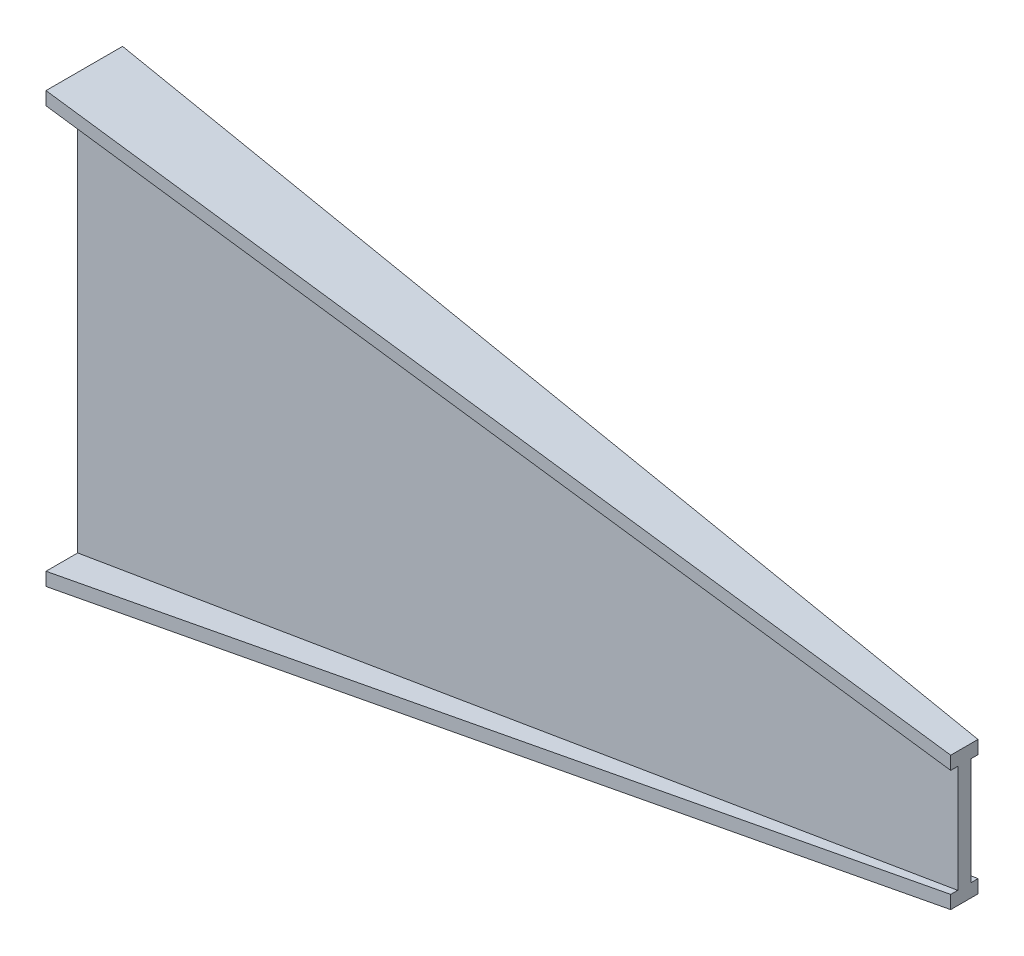
ISO-10303-21;
HEADER;
FILE_DESCRIPTION(('STEP AP214'),'2;1');
FILE_NAME('part.step','',(''),(''),'','','');
FILE_SCHEMA(('AUTOMOTIVE_DESIGN { 1 0 10303 214 1 1 1 1 }'));
ENDSEC;
DATA;
#1=APPLICATION_CONTEXT('core data for automotive mechanical design processes');
#2=APPLICATION_PROTOCOL_DEFINITION('international standard','automotive_design',2000,#1);
#3=PRODUCT_CONTEXT('',#1,'mechanical');
#4=PRODUCT('Part','Part','',(#3));
#5=PRODUCT_RELATED_PRODUCT_CATEGORY('part','',(#4));
#6=PRODUCT_DEFINITION_FORMATION('','',#4);
#7=PRODUCT_DEFINITION_CONTEXT('part definition',#1,'design');
#8=PRODUCT_DEFINITION('design','',#6,#7);
#9=PRODUCT_DEFINITION_SHAPE('','',#8);
#10=(LENGTH_UNIT() NAMED_UNIT(*) SI_UNIT(.MILLI.,.METRE.));
#11=(NAMED_UNIT(*) PLANE_ANGLE_UNIT() SI_UNIT($,.RADIAN.));
#12=(NAMED_UNIT(*) SI_UNIT($,.STERADIAN.) SOLID_ANGLE_UNIT());
#13=UNCERTAINTY_MEASURE_WITH_UNIT(LENGTH_MEASURE(1.E-05),#10,'distance_accuracy_value','');
#14=(GEOMETRIC_REPRESENTATION_CONTEXT(3) GLOBAL_UNCERTAINTY_ASSIGNED_CONTEXT((#13)) GLOBAL_UNIT_ASSIGNED_CONTEXT((#10,
#11,#12)) REPRESENTATION_CONTEXT('',''));
#15=CARTESIAN_POINT('',(0.,0.,0.));
#16=DIRECTION('',(0.,0.,1.));
#17=DIRECTION('',(1.,0.,0.));
#18=AXIS2_PLACEMENT_3D('',#15,#16,#17);
#19=CARTESIAN_POINT('',(1000.,0.,0.));
#20=DIRECTION('',(-1.,0.,0.));
#21=DIRECTION('',(0.,0.,1.));
#22=AXIS2_PLACEMENT_3D('',#19,#20,#21);
#23=PLANE('',#22);
#24=DIRECTION('',(0.,-1.,0.));
#25=VECTOR('',#24,1.);
#26=CARTESIAN_POINT('',(1000.,76.,-7.99999999999967));
#27=LINE('',#26,#25);
#28=CARTESIAN_POINT('',(1000.,76.,-7.99999999999967));
#29=VERTEX_POINT('',#28);
#30=CARTESIAN_POINT('',(1000.,61.,-7.99999999999967));
#31=VERTEX_POINT('',#30);
#32=EDGE_CURVE('E375',#29,#31,#27,.T.);
#33=ORIENTED_EDGE('',*,*,#32,.F.);
#34=DIRECTION('',(0.,0.,-1.));
#35=VECTOR('',#34,1.);
#36=CARTESIAN_POINT('',(1000.,76.,-7.99999999999967));
#37=LINE('',#36,#35);
#38=CARTESIAN_POINT('',(1000.,76.,23.0000000000004));
#39=VERTEX_POINT('',#38);
#40=EDGE_CURVE('E12',#39,#29,#37,.T.);
#41=ORIENTED_EDGE('',*,*,#40,.F.);
#42=DIRECTION('',(0.,1.,0.));
#43=VECTOR('',#42,1.);
#44=CARTESIAN_POINT('',(1000.,76.,23.0000000000004));
#45=LINE('',#44,#43);
#46=CARTESIAN_POINT('',(1000.,61.,23.0000000000004));
#47=VERTEX_POINT('',#46);
#48=EDGE_CURVE('E69',#47,#39,#45,.T.);
#49=ORIENTED_EDGE('',*,*,#48,.F.);
#50=DIRECTION('',(0.,0.,1.));
#51=VECTOR('',#50,1.);
#52=CARTESIAN_POINT('',(1000.,61.,15.0000000000003));
#53=LINE('',#52,#51);
#54=CARTESIAN_POINT('',(1000.,61.,15.0000000000003));
#55=VERTEX_POINT('',#54);
#56=EDGE_CURVE('E650',#55,#47,#53,.T.);
#57=ORIENTED_EDGE('',*,*,#56,.F.);
#58=DIRECTION('',(0.,1.,0.));
#59=VECTOR('',#58,1.);
#60=CARTESIAN_POINT('',(1000.,61.,15.0000000000003));
#61=LINE('',#60,#59);
#62=CARTESIAN_POINT('',(1000.,-61.,15.0000000000003));
#63=VERTEX_POINT('',#62);
#64=EDGE_CURVE('E412',#63,#55,#61,.T.);
#65=ORIENTED_EDGE('',*,*,#64,.F.);
#66=DIRECTION('',(0.,0.,-1.));
#67=VECTOR('',#66,1.);
#68=CARTESIAN_POINT('',(1000.,-61.,15.0000000000003));
#69=LINE('',#68,#67);
#70=CARTESIAN_POINT('',(1000.,-61.,23.0000000000004));
#71=VERTEX_POINT('',#70);
#72=EDGE_CURVE('E426',#71,#63,#69,.T.);
#73=ORIENTED_EDGE('',*,*,#72,.F.);
#74=DIRECTION('',(0.,1.,0.));
#75=VECTOR('',#74,1.);
#76=CARTESIAN_POINT('',(1000.,-61.,23.0000000000004));
#77=LINE('',#76,#75);
#78=CARTESIAN_POINT('',(1000.,-76.,23.0000000000004));
#79=VERTEX_POINT('',#78);
#80=EDGE_CURVE('E440',#79,#71,#77,.T.);
#81=ORIENTED_EDGE('',*,*,#80,.F.);
#82=DIRECTION('',(0.,0.,1.));
#83=VECTOR('',#82,1.);
#84=CARTESIAN_POINT('',(1000.,-76.,-7.99999999999967));
#85=LINE('',#84,#83);
#86=CARTESIAN_POINT('',(1000.,-76.,-7.99999999999967));
#87=VERTEX_POINT('',#86);
#88=EDGE_CURVE('E621',#87,#79,#85,.T.);
#89=ORIENTED_EDGE('',*,*,#88,.F.);
#90=DIRECTION('',(0.,-1.,0.));
#91=VECTOR('',#90,1.);
#92=CARTESIAN_POINT('',(1000.,-61.,-7.99999999999967));
#93=LINE('',#92,#91);
#94=CARTESIAN_POINT('',(1000.,-61.,-7.99999999999967));
#95=VERTEX_POINT('',#94);
#96=EDGE_CURVE('E613',#95,#87,#93,.T.);
#97=ORIENTED_EDGE('',*,*,#96,.F.);
#98=DIRECTION('',(0.,0.,-1.));
#99=VECTOR('',#98,1.);
#100=CARTESIAN_POINT('',(1000.,-61.,-7.99999999999967));
#101=LINE('',#100,#99);
#102=CARTESIAN_POINT('',(1000.,-61.,4.44089209850063E-13));
#103=VERTEX_POINT('',#102);
#104=EDGE_CURVE('E528',#103,#95,#101,.T.);
#105=ORIENTED_EDGE('',*,*,#104,.F.);
#106=DIRECTION('',(0.,-1.,0.));
#107=VECTOR('',#106,1.);
#108=CARTESIAN_POINT('',(1000.,61.,4.44089209850063E-13));
#109=LINE('',#108,#107);
#110=CARTESIAN_POINT('',(1000.,61.,4.44089209850063E-13));
#111=VERTEX_POINT('',#110);
#112=EDGE_CURVE('E83',#111,#103,#109,.T.);
#113=ORIENTED_EDGE('',*,*,#112,.F.);
#114=DIRECTION('',(0.,0.,1.));
#115=VECTOR('',#114,1.);
#116=CARTESIAN_POINT('',(1000.,61.,-7.99999999999967));
#117=LINE('',#116,#115);
#118=EDGE_CURVE('E77',#31,#111,#117,.T.);
#119=ORIENTED_EDGE('',*,*,#118,.F.);
#120=EDGE_LOOP('',(#33,#41,#49,#57,#65,#73,#81,#89,#97,#105,#113,#119));
#121=FACE_BOUND('',#120,.T.);
#122=ADVANCED_FACE('F59',(#121),#23,.F.);
#123=CARTESIAN_POINT('',(0.,0.,0.));
#124=DIRECTION('',(1.,0.,0.));
#125=DIRECTION('',(0.,0.,-1.));
#126=AXIS2_PLACEMENT_3D('',#123,#124,#125);
#127=PLANE('',#126);
#128=DIRECTION('',(0.,-1.,0.));
#129=VECTOR('',#128,1.);
#130=CARTESIAN_POINT('',(0.,244.,51.0000000000002));
#131=LINE('',#130,#129);
#132=CARTESIAN_POINT('',(0.,244.,51.0000000000002));
#133=VERTEX_POINT('',#132);
#134=CARTESIAN_POINT('',(0.,229.,51.0000000000002));
#135=VERTEX_POINT('',#134);
#136=EDGE_CURVE('E158',#133,#135,#131,.T.);
#137=ORIENTED_EDGE('',*,*,#136,.F.);
#138=DIRECTION('',(0.,0.,1.));
#139=VECTOR('',#138,1.);
#140=CARTESIAN_POINT('',(0.,244.,51.0000000000002));
#141=LINE('',#140,#139);
#142=CARTESIAN_POINT('',(0.,244.,-35.9999999999998));
#143=VERTEX_POINT('',#142);
#144=EDGE_CURVE('E167',#143,#133,#141,.T.);
#145=ORIENTED_EDGE('',*,*,#144,.F.);
#146=DIRECTION('',(0.,1.,0.));
#147=VECTOR('',#146,1.);
#148=CARTESIAN_POINT('',(0.,244.,-35.9999999999998));
#149=LINE('',#148,#147);
#150=CARTESIAN_POINT('',(0.,229.,-35.9999999999998));
#151=VERTEX_POINT('',#150);
#152=EDGE_CURVE('E174',#151,#143,#149,.T.);
#153=ORIENTED_EDGE('',*,*,#152,.F.);
#154=DIRECTION('',(0.,0.,-1.));
#155=VECTOR('',#154,1.);
#156=CARTESIAN_POINT('',(0.,229.,2.30106477373787E-13));
#157=LINE('',#156,#155);
#158=CARTESIAN_POINT('',(0.,229.,2.30106477373787E-13));
#159=VERTEX_POINT('',#158);
#160=EDGE_CURVE('E298',#159,#151,#157,.T.);
#161=ORIENTED_EDGE('',*,*,#160,.F.);
#162=DIRECTION('',(0.,1.,0.));
#163=VECTOR('',#162,1.);
#164=CARTESIAN_POINT('',(0.,229.,2.30106477373787E-13));
#165=LINE('',#164,#163);
#166=CARTESIAN_POINT('',(0.,-229.,2.30106477373787E-13));
#167=VERTEX_POINT('',#166);
#168=EDGE_CURVE('E294',#167,#159,#165,.T.);
#169=ORIENTED_EDGE('',*,*,#168,.F.);
#170=DIRECTION('',(0.,0.,1.));
#171=VECTOR('',#170,1.);
#172=CARTESIAN_POINT('',(0.,-229.,2.30106477373787E-13));
#173=LINE('',#172,#171);
#174=CARTESIAN_POINT('',(0.,-229.,-35.9999999999999));
#175=VERTEX_POINT('',#174);
#176=EDGE_CURVE('E290',#175,#167,#173,.T.);
#177=ORIENTED_EDGE('',*,*,#176,.F.);
#178=DIRECTION('',(0.,1.,0.));
#179=VECTOR('',#178,1.);
#180=CARTESIAN_POINT('',(0.,-229.,-35.9999999999999));
#181=LINE('',#180,#179);
#182=CARTESIAN_POINT('',(0.,-244.,-35.9999999999999));
#183=VERTEX_POINT('',#182);
#184=EDGE_CURVE('E286',#183,#175,#181,.T.);
#185=ORIENTED_EDGE('',*,*,#184,.F.);
#186=DIRECTION('',(0.,0.,-1.));
#187=VECTOR('',#186,1.);
#188=CARTESIAN_POINT('',(0.,-244.,51.0000000000001));
#189=LINE('',#188,#187);
#190=CARTESIAN_POINT('',(0.,-244.,51.0000000000001));
#191=VERTEX_POINT('',#190);
#192=EDGE_CURVE('E282',#191,#183,#189,.T.);
#193=ORIENTED_EDGE('',*,*,#192,.F.);
#194=DIRECTION('',(0.,-1.,0.));
#195=VECTOR('',#194,1.);
#196=CARTESIAN_POINT('',(0.,-229.,51.0000000000001));
#197=LINE('',#196,#195);
#198=CARTESIAN_POINT('',(0.,-229.,51.0000000000001));
#199=VERTEX_POINT('',#198);
#200=EDGE_CURVE('E278',#199,#191,#197,.T.);
#201=ORIENTED_EDGE('',*,*,#200,.F.);
#202=DIRECTION('',(0.,0.,1.));
#203=VECTOR('',#202,1.);
#204=CARTESIAN_POINT('',(0.,-229.,51.0000000000001));
#205=LINE('',#204,#203);
#206=CARTESIAN_POINT('',(0.,-229.,15.0000000000002));
#207=VERTEX_POINT('',#206);
#208=EDGE_CURVE('E273',#207,#199,#205,.T.);
#209=ORIENTED_EDGE('',*,*,#208,.F.);
#210=DIRECTION('',(0.,-1.,0.));
#211=VECTOR('',#210,1.);
#212=CARTESIAN_POINT('',(0.,229.,15.0000000000002));
#213=LINE('',#212,#211);
#214=CARTESIAN_POINT('',(0.,229.,15.0000000000002));
#215=VERTEX_POINT('',#214);
#216=EDGE_CURVE('E271',#215,#207,#213,.T.);
#217=ORIENTED_EDGE('',*,*,#216,.F.);
#218=DIRECTION('',(0.,0.,-1.));
#219=VECTOR('',#218,1.);
#220=CARTESIAN_POINT('',(0.,229.,51.0000000000002));
#221=LINE('',#220,#219);
#222=EDGE_CURVE('E180',#135,#215,#221,.T.);
#223=ORIENTED_EDGE('',*,*,#222,.F.);
#224=EDGE_LOOP('',(#137,#145,#153,#161,#169,#177,#185,#193,#201,#209,#217,#223));
#225=FACE_BOUND('',#224,.T.);
#226=ADVANCED_FACE('F178',(#225),#127,.F.);
#227=CARTESIAN_POINT('',(0.,0.,15.0000000000002));
#228=DIRECTION('',(0.,0.,1.));
#229=DIRECTION('',(1.,0.,0.));
#230=AXIS2_PLACEMENT_3D('',#227,#228,#229);
#231=PLANE('',#230);
#232=DIRECTION('',(0.9861798660721,0.165678217500113,0.));
#233=VECTOR('',#232,1.);
#234=CARTESIAN_POINT('',(0.,-229.,15.0000000000002));
#235=LINE('',#234,#233);
#236=EDGE_CURVE('E173',#207,#63,#235,.T.);
#237=ORIENTED_EDGE('',*,*,#236,.T.);
#238=ORIENTED_EDGE('',*,*,#64,.T.);
#239=DIRECTION('',(0.9861798660721,-0.165678217500113,0.));
#240=VECTOR('',#239,1.);
#241=CARTESIAN_POINT('',(0.,229.,15.0000000000002));
#242=LINE('',#241,#240);
#243=EDGE_CURVE('E385',#215,#55,#242,.T.);
#244=ORIENTED_EDGE('',*,*,#243,.F.);
#245=ORIENTED_EDGE('',*,*,#216,.T.);
#246=EDGE_LOOP('',(#237,#238,#244,#245));
#247=FACE_BOUND('',#246,.T.);
#248=ADVANCED_FACE('F201',(#247),#231,.T.);
#249=CARTESIAN_POINT('',(37.4159716170796,222.714116768331,0.));
#250=DIRECTION('',(-0.165678217500113,-0.9861798660721,0.));
#251=DIRECTION('',(0.9861798660721,-0.165678217500113,0.));
#252=AXIS2_PLACEMENT_3D('',#249,#250,#251);
#253=PLANE('',#252);
#254=ORIENTED_EDGE('',*,*,#243,.T.);
#255=ORIENTED_EDGE('',*,*,#56,.T.);
#256=DIRECTION('',(0.98580410983915,-0.165615090452977,-0.0276025150754961));
#257=VECTOR('',#256,1.);
#258=CARTESIAN_POINT('',(0.,229.,51.0000000000002));
#259=LINE('',#258,#257);
#260=EDGE_CURVE('E163',#135,#47,#259,.T.);
#261=ORIENTED_EDGE('',*,*,#260,.F.);
#262=ORIENTED_EDGE('',*,*,#222,.T.);
#263=EDGE_LOOP('',(#254,#255,#261,#262));
#264=FACE_BOUND('',#263,.T.);
#265=ADVANCED_FACE('F387',(#264),#253,.T.);
#266=CARTESIAN_POINT('',(37.4159716170795,-222.714116768331,0.));
#267=DIRECTION('',(-0.165678217500113,0.9861798660721,0.));
#268=DIRECTION('',(-0.9861798660721,-0.165678217500113,0.));
#269=AXIS2_PLACEMENT_3D('',#266,#267,#268);
#270=PLANE('',#269);
#271=DIRECTION('',(0.98580410983915,0.165615090452977,-0.0276025150754959));
#272=VECTOR('',#271,1.);
#273=CARTESIAN_POINT('',(0.,-229.,51.0000000000001));
#274=LINE('',#273,#272);
#275=EDGE_CURVE('E473',#199,#71,#274,.T.);
#276=ORIENTED_EDGE('',*,*,#275,.T.);
#277=ORIENTED_EDGE('',*,*,#72,.T.);
#278=ORIENTED_EDGE('',*,*,#236,.F.);
#279=ORIENTED_EDGE('',*,*,#208,.T.);
#280=EDGE_LOOP('',(#276,#277,#278,#279));
#281=FACE_BOUND('',#280,.T.);
#282=ADVANCED_FACE('F396',(#281),#270,.T.);
#283=CARTESIAN_POINT('',(1.42688132504116,0.,50.9600473228989));
#284=DIRECTION('',(0.0279890304496741,0.,0.999608230345512));
#285=DIRECTION('',(0.999608230345513,0.,-0.0279890304496741));
#286=AXIS2_PLACEMENT_3D('',#283,#284,#285);
#287=PLANE('',#286);
#288=DIRECTION('',(0.98580410983915,0.165615090452977,-0.0276025150754959));
#289=VECTOR('',#288,1.);
#290=CARTESIAN_POINT('',(0.,-244.,51.0000000000001));
#291=LINE('',#290,#289);
#292=EDGE_CURVE('E465',#191,#79,#291,.T.);
#293=ORIENTED_EDGE('',*,*,#292,.T.);
#294=ORIENTED_EDGE('',*,*,#80,.T.);
#295=ORIENTED_EDGE('',*,*,#275,.F.);
#296=ORIENTED_EDGE('',*,*,#200,.T.);
#297=EDGE_LOOP('',(#293,#294,#295,#296));
#298=FACE_BOUND('',#297,.T.);
#299=ADVANCED_FACE('F446',(#298),#287,.T.);
#300=CARTESIAN_POINT('',(39.8667994522594,-237.30237769202,-2.124665834774E-13));
#301=DIRECTION('',(0.165678217500113,-0.9861798660721,0.));
#302=DIRECTION('',(0.9861798660721,0.165678217500113,0.));
#303=AXIS2_PLACEMENT_3D('',#300,#301,#302);
#304=PLANE('',#303);
#305=DIRECTION('',(0.98580410983915,0.165615090452977,0.0276025150754964));
#306=VECTOR('',#305,1.);
#307=CARTESIAN_POINT('',(0.,-244.,-35.9999999999999));
#308=LINE('',#307,#306);
#309=EDGE_CURVE('E472',#183,#87,#308,.T.);
#310=ORIENTED_EDGE('',*,*,#309,.T.);
#311=ORIENTED_EDGE('',*,*,#88,.T.);
#312=ORIENTED_EDGE('',*,*,#292,.F.);
#313=ORIENTED_EDGE('',*,*,#192,.T.);
#314=EDGE_LOOP('',(#310,#311,#312,#313));
#315=FACE_BOUND('',#314,.T.);
#316=ADVANCED_FACE('F455',(#315),#304,.T.);
#317=CARTESIAN_POINT('',(1.00721034708789,0.,-35.9717981102814));
#318=DIRECTION('',(0.0279890304496746,0.,-0.999608230345512));
#319=DIRECTION('',(-0.999608230345512,0.,-0.0279890304496746));
#320=AXIS2_PLACEMENT_3D('',#317,#318,#319);
#321=PLANE('',#320);
#322=DIRECTION('',(0.98580410983915,0.165615090452977,0.0276025150754964));
#323=VECTOR('',#322,1.);
#324=CARTESIAN_POINT('',(0.,-229.,-35.9999999999999));
#325=LINE('',#324,#323);
#326=EDGE_CURVE('E490',#175,#95,#325,.T.);
#327=ORIENTED_EDGE('',*,*,#326,.T.);
#328=ORIENTED_EDGE('',*,*,#96,.T.);
#329=ORIENTED_EDGE('',*,*,#309,.F.);
#330=ORIENTED_EDGE('',*,*,#184,.T.);
#331=EDGE_LOOP('',(#327,#328,#329,#330));
#332=FACE_BOUND('',#331,.T.);
#333=ADVANCED_FACE('F501',(#332),#321,.T.);
#334=CARTESIAN_POINT('',(37.4159716170796,-222.714116768331,0.));
#335=DIRECTION('',(-0.165678217500113,0.9861798660721,0.));
#336=DIRECTION('',(-0.9861798660721,-0.165678217500113,0.));
#337=AXIS2_PLACEMENT_3D('',#334,#335,#336);
#338=PLANE('',#337);
#339=DIRECTION('',(0.9861798660721,0.165678217500113,0.));
#340=VECTOR('',#339,1.);
#341=CARTESIAN_POINT('',(0.,-229.,2.30106477373787E-13));
#342=LINE('',#341,#340);
#343=EDGE_CURVE('E567',#167,#103,#342,.T.);
#344=ORIENTED_EDGE('',*,*,#343,.T.);
#345=ORIENTED_EDGE('',*,*,#104,.T.);
#346=ORIENTED_EDGE('',*,*,#326,.F.);
#347=ORIENTED_EDGE('',*,*,#176,.T.);
#348=EDGE_LOOP('',(#344,#345,#346,#347));
#349=FACE_BOUND('',#348,.T.);
#350=ADVANCED_FACE('F510',(#349),#338,.T.);
#351=CARTESIAN_POINT('',(0.,0.,2.30106477373787E-13));
#352=DIRECTION('',(0.,0.,-1.));
#353=DIRECTION('',(-1.,0.,0.));
#354=AXIS2_PLACEMENT_3D('',#351,#352,#353);
#355=PLANE('',#354);
#356=DIRECTION('',(0.9861798660721,-0.165678217500113,0.));
#357=VECTOR('',#356,1.);
#358=CARTESIAN_POINT('',(0.,229.,2.30106477373787E-13));
#359=LINE('',#358,#357);
#360=EDGE_CURVE('E559',#159,#111,#359,.T.);
#361=ORIENTED_EDGE('',*,*,#360,.T.);
#362=ORIENTED_EDGE('',*,*,#112,.T.);
#363=ORIENTED_EDGE('',*,*,#343,.F.);
#364=ORIENTED_EDGE('',*,*,#168,.T.);
#365=EDGE_LOOP('',(#361,#362,#363,#364));
#366=FACE_BOUND('',#365,.T.);
#367=ADVANCED_FACE('F544',(#366),#355,.T.);
#368=CARTESIAN_POINT('',(37.4159716170795,222.714116768331,0.));
#369=DIRECTION('',(-0.165678217500113,-0.9861798660721,0.));
#370=DIRECTION('',(0.9861798660721,-0.165678217500113,0.));
#371=AXIS2_PLACEMENT_3D('',#368,#369,#370);
#372=PLANE('',#371);
#373=DIRECTION('',(0.98580410983915,-0.165615090452977,0.0276025150754963));
#374=VECTOR('',#373,1.);
#375=CARTESIAN_POINT('',(0.,229.,-35.9999999999998));
#376=LINE('',#375,#374);
#377=EDGE_CURVE('E566',#151,#31,#376,.T.);
#378=ORIENTED_EDGE('',*,*,#377,.T.);
#379=ORIENTED_EDGE('',*,*,#118,.T.);
#380=ORIENTED_EDGE('',*,*,#360,.F.);
#381=ORIENTED_EDGE('',*,*,#160,.T.);
#382=EDGE_LOOP('',(#378,#379,#380,#381));
#383=FACE_BOUND('',#382,.T.);
#384=ADVANCED_FACE('F325',(#383),#372,.T.);
#385=CARTESIAN_POINT('',(1.00721034708788,0.,-35.9717981102813));
#386=DIRECTION('',(0.0279890304496744,0.,-0.999608230345512));
#387=DIRECTION('',(-0.999608230345512,0.,-0.0279890304496744));
#388=AXIS2_PLACEMENT_3D('',#385,#386,#387);
#389=PLANE('',#388);
#390=DIRECTION('',(0.98580410983915,-0.165615090452977,0.0276025150754963));
#391=VECTOR('',#390,1.);
#392=CARTESIAN_POINT('',(0.,244.,-35.9999999999998));
#393=LINE('',#392,#391);
#394=EDGE_CURVE('E164',#143,#29,#393,.T.);
#395=ORIENTED_EDGE('',*,*,#394,.T.);
#396=ORIENTED_EDGE('',*,*,#32,.T.);
#397=ORIENTED_EDGE('',*,*,#377,.F.);
#398=ORIENTED_EDGE('',*,*,#152,.T.);
#399=EDGE_LOOP('',(#395,#396,#397,#398));
#400=FACE_BOUND('',#399,.T.);
#401=ADVANCED_FACE('F315',(#400),#389,.T.);
#402=CARTESIAN_POINT('',(39.8667994522594,237.30237769202,0.));
#403=DIRECTION('',(0.165678217500113,0.9861798660721,0.));
#404=DIRECTION('',(-0.9861798660721,0.165678217500113,0.));
#405=AXIS2_PLACEMENT_3D('',#402,#403,#404);
#406=PLANE('',#405);
#407=DIRECTION('',(0.98580410983915,-0.165615090452977,-0.0276025150754961));
#408=VECTOR('',#407,1.);
#409=CARTESIAN_POINT('',(0.,244.,51.0000000000002));
#410=LINE('',#409,#408);
#411=EDGE_CURVE('E153',#133,#39,#410,.T.);
#412=ORIENTED_EDGE('',*,*,#411,.T.);
#413=ORIENTED_EDGE('',*,*,#40,.T.);
#414=ORIENTED_EDGE('',*,*,#394,.F.);
#415=ORIENTED_EDGE('',*,*,#144,.T.);
#416=EDGE_LOOP('',(#412,#413,#414,#415));
#417=FACE_BOUND('',#416,.T.);
#418=ADVANCED_FACE('F169',(#417),#406,.T.);
#419=CARTESIAN_POINT('',(1.42688132504117,0.,50.9600473228991));
#420=DIRECTION('',(0.0279890304496742,0.,0.999608230345512));
#421=DIRECTION('',(0.999608230345513,0.,-0.0279890304496742));
#422=AXIS2_PLACEMENT_3D('',#419,#420,#421);
#423=PLANE('',#422);
#424=ORIENTED_EDGE('',*,*,#260,.T.);
#425=ORIENTED_EDGE('',*,*,#48,.T.);
#426=ORIENTED_EDGE('',*,*,#411,.F.);
#427=ORIENTED_EDGE('',*,*,#136,.T.);
#428=EDGE_LOOP('',(#424,#425,#426,#427));
#429=FACE_BOUND('',#428,.T.);
#430=ADVANCED_FACE('F156',(#429),#423,.T.);
#431=CLOSED_SHELL('',(#122,#226,#248,#265,#282,#299,#316,#333,#350,#367,#384,#401,#418,#430));
#432=MANIFOLD_SOLID_BREP('B2',#431);
#433=ADVANCED_BREP_SHAPE_REPRESENTATION('',(#18,#432),#14);
#434=SHAPE_DEFINITION_REPRESENTATION(#9,#433);
ENDSEC;
END-ISO-10303-21;
